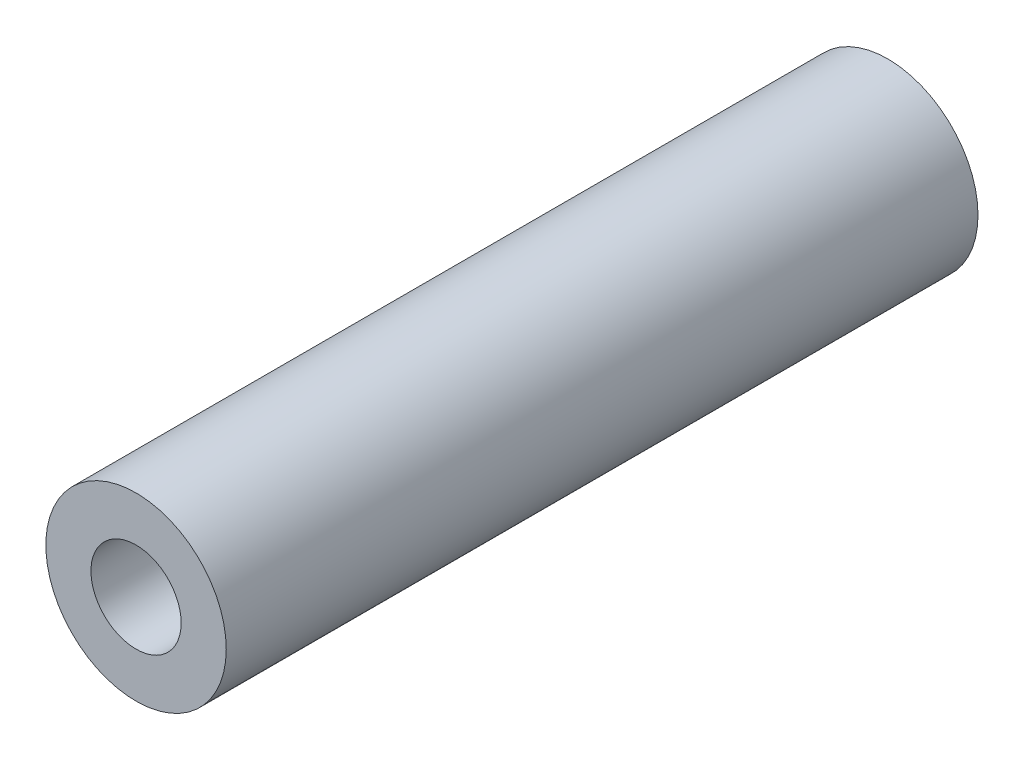
ISO-10303-21;
HEADER;
FILE_DESCRIPTION(('STEP AP214'),'2;1');
FILE_NAME('part.step','',(''),(''),'','','');
FILE_SCHEMA(('AUTOMOTIVE_DESIGN { 1 0 10303 214 1 1 1 1 }'));
ENDSEC;
DATA;
#1=APPLICATION_CONTEXT('core data for automotive mechanical design processes');
#2=APPLICATION_PROTOCOL_DEFINITION('international standard','automotive_design',2000,#1);
#3=PRODUCT_CONTEXT('',#1,'mechanical');
#4=PRODUCT('Part','Part','',(#3));
#5=PRODUCT_RELATED_PRODUCT_CATEGORY('part','',(#4));
#6=PRODUCT_DEFINITION_FORMATION('','',#4);
#7=PRODUCT_DEFINITION_CONTEXT('part definition',#1,'design');
#8=PRODUCT_DEFINITION('design','',#6,#7);
#9=PRODUCT_DEFINITION_SHAPE('','',#8);
#10=(LENGTH_UNIT() NAMED_UNIT(*) SI_UNIT(.MILLI.,.METRE.));
#11=(NAMED_UNIT(*) PLANE_ANGLE_UNIT() SI_UNIT($,.RADIAN.));
#12=(NAMED_UNIT(*) SI_UNIT($,.STERADIAN.) SOLID_ANGLE_UNIT());
#13=UNCERTAINTY_MEASURE_WITH_UNIT(LENGTH_MEASURE(1.E-05),#10,'distance_accuracy_value','');
#14=(GEOMETRIC_REPRESENTATION_CONTEXT(3) GLOBAL_UNCERTAINTY_ASSIGNED_CONTEXT((#13)) GLOBAL_UNIT_ASSIGNED_CONTEXT((#10,
#11,#12)) REPRESENTATION_CONTEXT('',''));
#15=CARTESIAN_POINT('',(0.,0.,0.));
#16=DIRECTION('',(0.,0.,1.));
#17=DIRECTION('',(1.,0.,0.));
#18=AXIS2_PLACEMENT_3D('',#15,#16,#17);
#19=CARTESIAN_POINT('',(0.,0.,12.5));
#20=DIRECTION('',(0.,0.,1.));
#21=DIRECTION('',(1.,0.,0.));
#22=AXIS2_PLACEMENT_3D('',#19,#20,#21);
#23=PLANE('',#22);
#24=CARTESIAN_POINT('',(0.,0.,12.5));
#25=DIRECTION('',(0.,0.,1.));
#26=DIRECTION('',(1.,0.,0.));
#27=AXIS2_PLACEMENT_3D('',#24,#25,#26);
#28=CIRCLE('',#27,3.);
#29=CARTESIAN_POINT('',(3.,0.,12.5));
#30=VERTEX_POINT('',#29);
#31=EDGE_CURVE('E10',#30,#30,#28,.T.);
#32=ORIENTED_EDGE('',*,*,#31,.T.);
#33=EDGE_LOOP('',(#32));
#34=FACE_BOUND('',#33,.T.);
#35=CARTESIAN_POINT('',(0.,0.,12.5));
#36=DIRECTION('',(0.,0.,1.));
#37=DIRECTION('',(1.,0.,0.));
#38=AXIS2_PLACEMENT_3D('',#35,#36,#37);
#39=CIRCLE('',#38,1.5);
#40=CARTESIAN_POINT('',(1.5,0.,12.5));
#41=VERTEX_POINT('',#40);
#42=EDGE_CURVE('E42',#41,#41,#39,.T.);
#43=ORIENTED_EDGE('',*,*,#42,.F.);
#44=EDGE_LOOP('',(#43));
#45=FACE_BOUND('',#44,.T.);
#46=ADVANCED_FACE('F31',(#34,#45),#23,.T.);
#47=CARTESIAN_POINT('',(0.,0.,-12.5));
#48=DIRECTION('',(0.,0.,1.));
#49=DIRECTION('',(1.,0.,0.));
#50=AXIS2_PLACEMENT_3D('',#47,#48,#49);
#51=PLANE('',#50);
#52=CARTESIAN_POINT('',(0.,0.,-12.5));
#53=DIRECTION('',(0.,0.,1.));
#54=DIRECTION('',(1.,0.,0.));
#55=AXIS2_PLACEMENT_3D('',#52,#53,#54);
#56=CIRCLE('',#55,3.);
#57=CARTESIAN_POINT('',(3.,0.,-12.5));
#58=VERTEX_POINT('',#57);
#59=EDGE_CURVE('E35',#58,#58,#56,.T.);
#60=ORIENTED_EDGE('',*,*,#59,.F.);
#61=EDGE_LOOP('',(#60));
#62=FACE_BOUND('',#61,.T.);
#63=CARTESIAN_POINT('',(0.,0.,-12.5));
#64=DIRECTION('',(0.,0.,1.));
#65=DIRECTION('',(1.,0.,0.));
#66=AXIS2_PLACEMENT_3D('',#63,#64,#65);
#67=CIRCLE('',#66,1.5);
#68=CARTESIAN_POINT('',(1.5,0.,-12.5));
#69=VERTEX_POINT('',#68);
#70=EDGE_CURVE('E44',#69,#69,#67,.T.);
#71=ORIENTED_EDGE('',*,*,#70,.T.);
#72=EDGE_LOOP('',(#71));
#73=FACE_BOUND('',#72,.T.);
#74=ADVANCED_FACE('F54',(#62,#73),#51,.F.);
#75=CARTESIAN_POINT('',(0.,0.,12.5));
#76=DIRECTION('',(0.,0.,-1.));
#77=DIRECTION('',(-1.,0.,0.));
#78=AXIS2_PLACEMENT_3D('',#75,#76,#77);
#79=CYLINDRICAL_SURFACE('',#78,3.);
#80=ORIENTED_EDGE('',*,*,#31,.F.);
#81=EDGE_LOOP('',(#80));
#82=FACE_BOUND('',#81,.T.);
#83=ORIENTED_EDGE('',*,*,#59,.T.);
#84=EDGE_LOOP('',(#83));
#85=FACE_BOUND('',#84,.T.);
#86=ADVANCED_FACE('F33',(#82,#85),#79,.T.);
#87=CARTESIAN_POINT('',(0.,0.,12.5));
#88=DIRECTION('',(0.,0.,-1.));
#89=DIRECTION('',(-1.,0.,0.));
#90=AXIS2_PLACEMENT_3D('',#87,#88,#89);
#91=CYLINDRICAL_SURFACE('',#90,1.5);
#92=ORIENTED_EDGE('',*,*,#42,.T.);
#93=EDGE_LOOP('',(#92));
#94=FACE_BOUND('',#93,.T.);
#95=ORIENTED_EDGE('',*,*,#70,.F.);
#96=EDGE_LOOP('',(#95));
#97=FACE_BOUND('',#96,.T.);
#98=ADVANCED_FACE('F50',(#94,#97),#91,.F.);
#99=CLOSED_SHELL('',(#46,#74,#86,#98));
#100=MANIFOLD_SOLID_BREP('B2',#99);
#101=ADVANCED_BREP_SHAPE_REPRESENTATION('',(#18,#100),#14);
#102=SHAPE_DEFINITION_REPRESENTATION(#9,#101);
ENDSEC;
END-ISO-10303-21;
